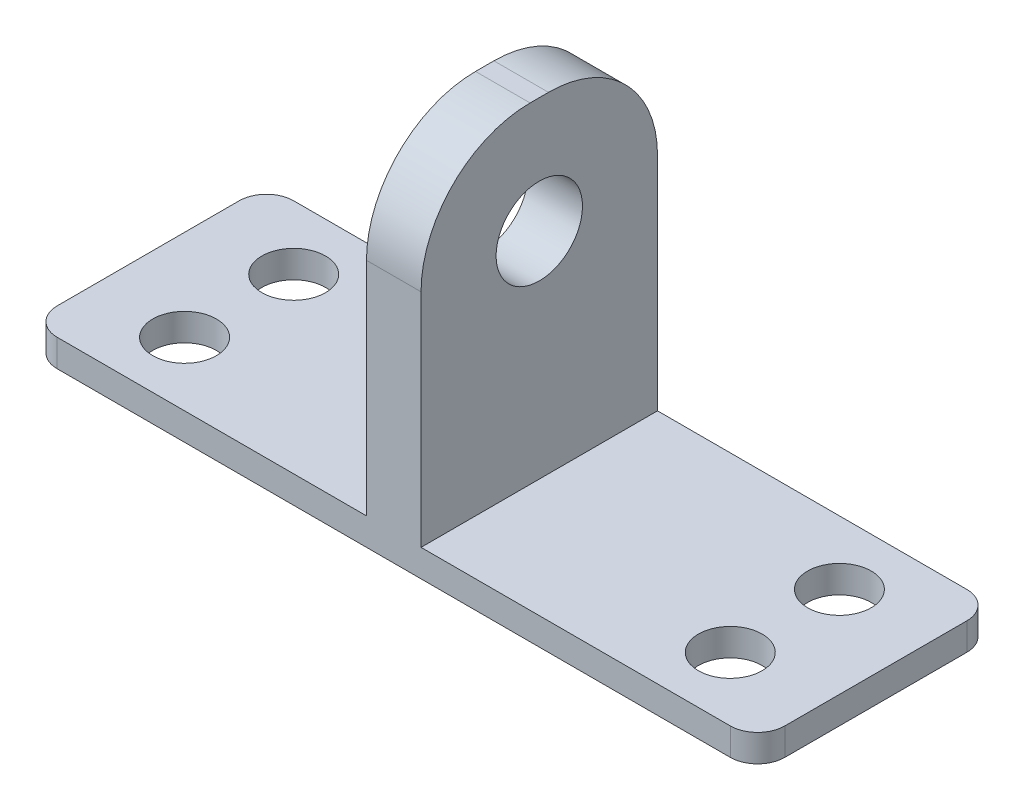
ISO-10303-21;
HEADER;
FILE_DESCRIPTION(('STEP AP214'),'2;1');
FILE_NAME('part.step','',(''),(''),'','','');
FILE_SCHEMA(('AUTOMOTIVE_DESIGN { 1 0 10303 214 1 1 1 1 }'));
ENDSEC;
DATA;
#1=APPLICATION_CONTEXT('core data for automotive mechanical design processes');
#2=APPLICATION_PROTOCOL_DEFINITION('international standard','automotive_design',2000,#1);
#3=PRODUCT_CONTEXT('',#1,'mechanical');
#4=PRODUCT('Part','Part','',(#3));
#5=PRODUCT_RELATED_PRODUCT_CATEGORY('part','',(#4));
#6=PRODUCT_DEFINITION_FORMATION('','',#4);
#7=PRODUCT_DEFINITION_CONTEXT('part definition',#1,'design');
#8=PRODUCT_DEFINITION('design','',#6,#7);
#9=PRODUCT_DEFINITION_SHAPE('','',#8);
#10=(LENGTH_UNIT() NAMED_UNIT(*) SI_UNIT(.MILLI.,.METRE.));
#11=(NAMED_UNIT(*) PLANE_ANGLE_UNIT() SI_UNIT($,.RADIAN.));
#12=(NAMED_UNIT(*) SI_UNIT($,.STERADIAN.) SOLID_ANGLE_UNIT());
#13=UNCERTAINTY_MEASURE_WITH_UNIT(LENGTH_MEASURE(1.E-05),#10,'distance_accuracy_value','');
#14=(GEOMETRIC_REPRESENTATION_CONTEXT(3) GLOBAL_UNCERTAINTY_ASSIGNED_CONTEXT((#13)) GLOBAL_UNIT_ASSIGNED_CONTEXT((#10,
#11,#12)) REPRESENTATION_CONTEXT('',''));
#15=CARTESIAN_POINT('',(0.,0.,0.));
#16=DIRECTION('',(0.,0.,1.));
#17=DIRECTION('',(1.,0.,0.));
#18=AXIS2_PLACEMENT_3D('',#15,#16,#17);
#19=CARTESIAN_POINT('',(0.,3.,0.));
#20=DIRECTION('',(0.,1.,0.));
#21=DIRECTION('',(0.,0.,1.));
#22=AXIS2_PLACEMENT_3D('',#19,#20,#21);
#23=PLANE('',#22);
#24=CARTESIAN_POINT('',(70.,3.,19.));
#25=DIRECTION('',(0.,1.,0.));
#26=DIRECTION('',(0.,0.,-1.));
#27=AXIS2_PLACEMENT_3D('',#24,#25,#26);
#28=CIRCLE('',#27,3.50000000000001);
#29=CARTESIAN_POINT('',(70.,3.,15.5));
#30=VERTEX_POINT('',#29);
#31=EDGE_CURVE('E246',#30,#30,#28,.T.);
#32=ORIENTED_EDGE('',*,*,#31,.F.);
#33=EDGE_LOOP('',(#32));
#34=FACE_BOUND('',#33,.T.);
#35=CARTESIAN_POINT('',(70.,3.,7.00000000000001));
#36=DIRECTION('',(0.,1.,0.));
#37=DIRECTION('',(0.,0.,1.));
#38=AXIS2_PLACEMENT_3D('',#35,#36,#37);
#39=CIRCLE('',#38,3.50000000000001);
#40=CARTESIAN_POINT('',(70.,3.,10.5));
#41=VERTEX_POINT('',#40);
#42=EDGE_CURVE('E253',#41,#41,#39,.T.);
#43=ORIENTED_EDGE('',*,*,#42,.F.);
#44=EDGE_LOOP('',(#43));
#45=FACE_BOUND('',#44,.T.);
#46=DIRECTION('',(-1.,0.,0.));
#47=VECTOR('',#46,1.);
#48=CARTESIAN_POINT('',(80.,3.,0.));
#49=LINE('',#48,#47);
#50=CARTESIAN_POINT('',(77.0028,3.,0.));
#51=VERTEX_POINT('',#50);
#52=CARTESIAN_POINT('',(43.,3.,0.));
#53=VERTEX_POINT('',#52);
#54=EDGE_CURVE('E139',#51,#53,#49,.T.);
#55=ORIENTED_EDGE('',*,*,#54,.T.);
#56=DIRECTION('',(0.,0.,1.));
#57=VECTOR('',#56,1.);
#58=CARTESIAN_POINT('',(43.,3.,0.));
#59=LINE('',#58,#57);
#60=CARTESIAN_POINT('',(43.,3.,26.));
#61=VERTEX_POINT('',#60);
#62=EDGE_CURVE('E148',#53,#61,#59,.T.);
#63=ORIENTED_EDGE('',*,*,#62,.T.);
#64=DIRECTION('',(1.,0.,0.));
#65=VECTOR('',#64,1.);
#66=CARTESIAN_POINT('',(0.,3.,26.));
#67=LINE('',#66,#65);
#68=CARTESIAN_POINT('',(77.0028,3.,26.));
#69=VERTEX_POINT('',#68);
#70=EDGE_CURVE('E242',#61,#69,#67,.T.);
#71=ORIENTED_EDGE('',*,*,#70,.T.);
#72=CARTESIAN_POINT('',(77.0028,3.,23.0028));
#73=DIRECTION('',(0.,1.,0.));
#74=DIRECTION('',(0.,0.,1.));
#75=AXIS2_PLACEMENT_3D('',#72,#73,#74);
#76=CIRCLE('',#75,2.9972);
#77=CARTESIAN_POINT('',(80.,3.,23.0028));
#78=VERTEX_POINT('',#77);
#79=EDGE_CURVE('E203',#69,#78,#76,.T.);
#80=ORIENTED_EDGE('',*,*,#79,.T.);
#81=DIRECTION('',(0.,0.,-1.));
#82=VECTOR('',#81,1.);
#83=CARTESIAN_POINT('',(80.,3.,26.));
#84=LINE('',#83,#82);
#85=CARTESIAN_POINT('',(80.,3.,2.99720000000001));
#86=VERTEX_POINT('',#85);
#87=EDGE_CURVE('E164',#78,#86,#84,.T.);
#88=ORIENTED_EDGE('',*,*,#87,.T.);
#89=CARTESIAN_POINT('',(77.0028,3.,2.9972));
#90=DIRECTION('',(0.,1.,0.));
#91=DIRECTION('',(0.,0.,1.));
#92=AXIS2_PLACEMENT_3D('',#89,#90,#91);
#93=CIRCLE('',#92,2.9972);
#94=EDGE_CURVE('E158',#86,#51,#93,.T.);
#95=ORIENTED_EDGE('',*,*,#94,.T.);
#96=EDGE_LOOP('',(#55,#63,#71,#80,#88,#95));
#97=FACE_BOUND('',#96,.T.);
#98=ADVANCED_FACE('F33',(#34,#45,#97),#23,.T.);
#99=DIRECTION('',(0.,0.,1.));
#100=VECTOR('',#99,1.);
#101=CARTESIAN_POINT('',(37.,3.,0.));
#102=LINE('',#101,#100);
#103=CARTESIAN_POINT('',(37.,3.,0.));
#104=VERTEX_POINT('',#103);
#105=CARTESIAN_POINT('',(37.,3.,26.));
#106=VERTEX_POINT('',#105);
#107=EDGE_CURVE('E153',#104,#106,#102,.T.);
#108=ORIENTED_EDGE('',*,*,#107,.F.);
#109=CARTESIAN_POINT('',(2.99720000000001,3.,0.));
#110=VERTEX_POINT('',#109);
#111=EDGE_CURVE('E160',#104,#110,#49,.T.);
#112=ORIENTED_EDGE('',*,*,#111,.T.);
#113=CARTESIAN_POINT('',(2.9972,3.,2.9972));
#114=DIRECTION('',(0.,1.,0.));
#115=DIRECTION('',(0.,0.,1.));
#116=AXIS2_PLACEMENT_3D('',#113,#114,#115);
#117=CIRCLE('',#116,2.9972);
#118=CARTESIAN_POINT('',(0.,3.,2.9972));
#119=VERTEX_POINT('',#118);
#120=EDGE_CURVE('E199',#110,#119,#117,.T.);
#121=ORIENTED_EDGE('',*,*,#120,.T.);
#122=DIRECTION('',(0.,0.,1.));
#123=VECTOR('',#122,1.);
#124=CARTESIAN_POINT('',(0.,3.,0.));
#125=LINE('',#124,#123);
#126=CARTESIAN_POINT('',(0.,3.,23.0028));
#127=VERTEX_POINT('',#126);
#128=EDGE_CURVE('E180',#119,#127,#125,.T.);
#129=ORIENTED_EDGE('',*,*,#128,.T.);
#130=CARTESIAN_POINT('',(2.9972,3.,23.0028));
#131=DIRECTION('',(0.,1.,0.));
#132=DIRECTION('',(0.,0.,1.));
#133=AXIS2_PLACEMENT_3D('',#130,#131,#132);
#134=CIRCLE('',#133,2.9972);
#135=CARTESIAN_POINT('',(2.9972,3.,26.));
#136=VERTEX_POINT('',#135);
#137=EDGE_CURVE('E201',#127,#136,#134,.T.);
#138=ORIENTED_EDGE('',*,*,#137,.T.);
#139=EDGE_CURVE('E270',#136,#106,#67,.T.);
#140=ORIENTED_EDGE('',*,*,#139,.T.);
#141=EDGE_LOOP('',(#108,#112,#121,#129,#138,#140));
#142=FACE_BOUND('',#141,.T.);
#143=CARTESIAN_POINT('',(10.,3.,19.));
#144=DIRECTION('',(0.,1.,0.));
#145=DIRECTION('',(0.,0.,1.));
#146=AXIS2_PLACEMENT_3D('',#143,#144,#145);
#147=CIRCLE('',#146,3.5);
#148=CARTESIAN_POINT('',(10.,3.,22.5));
#149=VERTEX_POINT('',#148);
#150=EDGE_CURVE('E172',#149,#149,#147,.T.);
#151=ORIENTED_EDGE('',*,*,#150,.F.);
#152=EDGE_LOOP('',(#151));
#153=FACE_BOUND('',#152,.T.);
#154=CARTESIAN_POINT('',(9.99999999999999,3.,7.00000000000001));
#155=DIRECTION('',(0.,1.,0.));
#156=DIRECTION('',(0.,0.,-1.));
#157=AXIS2_PLACEMENT_3D('',#154,#155,#156);
#158=CIRCLE('',#157,3.5);
#159=CARTESIAN_POINT('',(9.99999999999999,3.,3.50000000000001));
#160=VERTEX_POINT('',#159);
#161=EDGE_CURVE('E259',#160,#160,#158,.T.);
#162=ORIENTED_EDGE('',*,*,#161,.F.);
#163=EDGE_LOOP('',(#162));
#164=FACE_BOUND('',#163,.T.);
#165=ADVANCED_FACE('F299',(#142,#153,#164),#23,.T.);
#166=CARTESIAN_POINT('',(0.,0.,0.));
#167=DIRECTION('',(0.,1.,0.));
#168=DIRECTION('',(0.,0.,1.));
#169=AXIS2_PLACEMENT_3D('',#166,#167,#168);
#170=PLANE('',#169);
#171=DIRECTION('',(0.,0.,-1.));
#172=VECTOR('',#171,1.);
#173=CARTESIAN_POINT('',(80.,0.,26.));
#174=LINE('',#173,#172);
#175=CARTESIAN_POINT('',(80.,0.,23.0028));
#176=VERTEX_POINT('',#175);
#177=CARTESIAN_POINT('',(80.,0.,2.99720000000001));
#178=VERTEX_POINT('',#177);
#179=EDGE_CURVE('E175',#176,#178,#174,.T.);
#180=ORIENTED_EDGE('',*,*,#179,.F.);
#181=CARTESIAN_POINT('',(77.0028,0.,23.0028));
#182=DIRECTION('',(0.,1.,0.));
#183=DIRECTION('',(0.,0.,1.));
#184=AXIS2_PLACEMENT_3D('',#181,#182,#183);
#185=CIRCLE('',#184,2.9972);
#186=CARTESIAN_POINT('',(77.0028,0.,26.));
#187=VERTEX_POINT('',#186);
#188=EDGE_CURVE('E190',#176,#187,#185,.F.);
#189=ORIENTED_EDGE('',*,*,#188,.T.);
#190=DIRECTION('',(1.,0.,0.));
#191=VECTOR('',#190,1.);
#192=CARTESIAN_POINT('',(0.,0.,26.));
#193=LINE('',#192,#191);
#194=CARTESIAN_POINT('',(2.9972,0.,26.));
#195=VERTEX_POINT('',#194);
#196=EDGE_CURVE('E171',#195,#187,#193,.T.);
#197=ORIENTED_EDGE('',*,*,#196,.F.);
#198=CARTESIAN_POINT('',(2.9972,0.,23.0028));
#199=DIRECTION('',(0.,1.,0.));
#200=DIRECTION('',(0.,0.,1.));
#201=AXIS2_PLACEMENT_3D('',#198,#199,#200);
#202=CIRCLE('',#201,2.9972);
#203=CARTESIAN_POINT('',(0.,0.,23.0028));
#204=VERTEX_POINT('',#203);
#205=EDGE_CURVE('E188',#195,#204,#202,.F.);
#206=ORIENTED_EDGE('',*,*,#205,.T.);
#207=DIRECTION('',(0.,0.,1.));
#208=VECTOR('',#207,1.);
#209=CARTESIAN_POINT('',(0.,0.,0.));
#210=LINE('',#209,#208);
#211=CARTESIAN_POINT('',(0.,0.,2.9972));
#212=VERTEX_POINT('',#211);
#213=EDGE_CURVE('E168',#212,#204,#210,.T.);
#214=ORIENTED_EDGE('',*,*,#213,.F.);
#215=CARTESIAN_POINT('',(2.9972,0.,2.9972));
#216=DIRECTION('',(0.,1.,0.));
#217=DIRECTION('',(0.,0.,1.));
#218=AXIS2_PLACEMENT_3D('',#215,#216,#217);
#219=CIRCLE('',#218,2.9972);
#220=CARTESIAN_POINT('',(2.99720000000001,0.,0.));
#221=VERTEX_POINT('',#220);
#222=EDGE_CURVE('E186',#212,#221,#219,.F.);
#223=ORIENTED_EDGE('',*,*,#222,.T.);
#224=DIRECTION('',(-1.,0.,0.));
#225=VECTOR('',#224,1.);
#226=CARTESIAN_POINT('',(80.,0.,0.));
#227=LINE('',#226,#225);
#228=CARTESIAN_POINT('',(77.0028,0.,0.));
#229=VERTEX_POINT('',#228);
#230=EDGE_CURVE('E178',#229,#221,#227,.T.);
#231=ORIENTED_EDGE('',*,*,#230,.F.);
#232=CARTESIAN_POINT('',(77.0028,0.,2.9972));
#233=DIRECTION('',(0.,1.,0.));
#234=DIRECTION('',(0.,0.,1.));
#235=AXIS2_PLACEMENT_3D('',#232,#233,#234);
#236=CIRCLE('',#235,2.9972);
#237=EDGE_CURVE('E184',#229,#178,#236,.F.);
#238=ORIENTED_EDGE('',*,*,#237,.T.);
#239=EDGE_LOOP('',(#180,#189,#197,#206,#214,#223,#231,#238));
#240=FACE_BOUND('',#239,.T.);
#241=CARTESIAN_POINT('',(10.,0.,19.));
#242=DIRECTION('',(0.,1.,0.));
#243=DIRECTION('',(0.,0.,1.));
#244=AXIS2_PLACEMENT_3D('',#241,#242,#243);
#245=CIRCLE('',#244,3.5);
#246=CARTESIAN_POINT('',(10.,0.,22.5));
#247=VERTEX_POINT('',#246);
#248=EDGE_CURVE('E262',#247,#247,#245,.T.);
#249=ORIENTED_EDGE('',*,*,#248,.T.);
#250=EDGE_LOOP('',(#249));
#251=FACE_BOUND('',#250,.T.);
#252=CARTESIAN_POINT('',(9.99999999999999,0.,7.00000000000001));
#253=DIRECTION('',(0.,1.,0.));
#254=DIRECTION('',(0.,0.,-1.));
#255=AXIS2_PLACEMENT_3D('',#252,#253,#254);
#256=CIRCLE('',#255,3.5);
#257=CARTESIAN_POINT('',(9.99999999999999,0.,3.50000000000001));
#258=VERTEX_POINT('',#257);
#259=EDGE_CURVE('E256',#258,#258,#256,.T.);
#260=ORIENTED_EDGE('',*,*,#259,.T.);
#261=EDGE_LOOP('',(#260));
#262=FACE_BOUND('',#261,.T.);
#263=CARTESIAN_POINT('',(70.,0.,7.00000000000001));
#264=DIRECTION('',(0.,1.,0.));
#265=DIRECTION('',(0.,0.,1.));
#266=AXIS2_PLACEMENT_3D('',#263,#264,#265);
#267=CIRCLE('',#266,3.50000000000001);
#268=CARTESIAN_POINT('',(70.,0.,10.5));
#269=VERTEX_POINT('',#268);
#270=EDGE_CURVE('E251',#269,#269,#267,.T.);
#271=ORIENTED_EDGE('',*,*,#270,.T.);
#272=EDGE_LOOP('',(#271));
#273=FACE_BOUND('',#272,.T.);
#274=CARTESIAN_POINT('',(70.,0.,19.));
#275=DIRECTION('',(0.,1.,0.));
#276=DIRECTION('',(0.,0.,-1.));
#277=AXIS2_PLACEMENT_3D('',#274,#275,#276);
#278=CIRCLE('',#277,3.50000000000001);
#279=CARTESIAN_POINT('',(70.,0.,15.5));
#280=VERTEX_POINT('',#279);
#281=EDGE_CURVE('E243',#280,#280,#278,.T.);
#282=ORIENTED_EDGE('',*,*,#281,.T.);
#283=EDGE_LOOP('',(#282));
#284=FACE_BOUND('',#283,.T.);
#285=ADVANCED_FACE('F287',(#240,#251,#262,#273,#284),#170,.F.);
#286=CARTESIAN_POINT('',(0.,3.,0.));
#287=DIRECTION('',(1.,0.,0.));
#288=DIRECTION('',(0.,0.,-1.));
#289=AXIS2_PLACEMENT_3D('',#286,#287,#288);
#290=PLANE('',#289);
#291=ORIENTED_EDGE('',*,*,#213,.T.);
#292=DIRECTION('',(0.,-1.,0.));
#293=VECTOR('',#292,1.);
#294=CARTESIAN_POINT('',(0.,3.,23.0028));
#295=LINE('',#294,#293);
#296=EDGE_CURVE('E208',#204,#127,#295,.F.);
#297=ORIENTED_EDGE('',*,*,#296,.T.);
#298=ORIENTED_EDGE('',*,*,#128,.F.);
#299=DIRECTION('',(0.,-1.,0.));
#300=VECTOR('',#299,1.);
#301=CARTESIAN_POINT('',(0.,3.,2.9972));
#302=LINE('',#301,#300);
#303=EDGE_CURVE('E205',#119,#212,#302,.T.);
#304=ORIENTED_EDGE('',*,*,#303,.T.);
#305=EDGE_LOOP('',(#291,#297,#298,#304));
#306=FACE_BOUND('',#305,.T.);
#307=ADVANCED_FACE('F303',(#306),#290,.F.);
#308=CARTESIAN_POINT('',(0.,3.,26.));
#309=DIRECTION('',(0.,0.,-1.));
#310=DIRECTION('',(-1.,0.,0.));
#311=AXIS2_PLACEMENT_3D('',#308,#309,#310);
#312=PLANE('',#311);
#313=DIRECTION('',(0.,-1.,0.));
#314=VECTOR('',#313,1.);
#315=CARTESIAN_POINT('',(43.,39.322,26.));
#316=LINE('',#315,#314);
#317=CARTESIAN_POINT('',(43.,27.3332,26.));
#318=VERTEX_POINT('',#317);
#319=EDGE_CURVE('E144',#318,#61,#316,.T.);
#320=ORIENTED_EDGE('',*,*,#319,.F.);
#321=DIRECTION('',(1.,0.,0.));
#322=VECTOR('',#321,1.);
#323=CARTESIAN_POINT('',(0.,27.3332,26.));
#324=LINE('',#323,#322);
#325=CARTESIAN_POINT('',(37.,27.3332,26.));
#326=VERTEX_POINT('',#325);
#327=EDGE_CURVE('E56',#318,#326,#324,.F.);
#328=ORIENTED_EDGE('',*,*,#327,.T.);
#329=DIRECTION('',(0.,-1.,0.));
#330=VECTOR('',#329,1.);
#331=CARTESIAN_POINT('',(37.,39.322,26.));
#332=LINE('',#331,#330);
#333=EDGE_CURVE('E231',#326,#106,#332,.T.);
#334=ORIENTED_EDGE('',*,*,#333,.T.);
#335=ORIENTED_EDGE('',*,*,#139,.F.);
#336=DIRECTION('',(0.,-1.,0.));
#337=VECTOR('',#336,1.);
#338=CARTESIAN_POINT('',(2.9972,3.,26.));
#339=LINE('',#338,#337);
#340=EDGE_CURVE('E192',#136,#195,#339,.T.);
#341=ORIENTED_EDGE('',*,*,#340,.T.);
#342=ORIENTED_EDGE('',*,*,#196,.T.);
#343=DIRECTION('',(0.,-1.,0.));
#344=VECTOR('',#343,1.);
#345=CARTESIAN_POINT('',(77.0028,3.,26.));
#346=LINE('',#345,#344);
#347=EDGE_CURVE('E195',#187,#69,#346,.F.);
#348=ORIENTED_EDGE('',*,*,#347,.T.);
#349=ORIENTED_EDGE('',*,*,#70,.F.);
#350=EDGE_LOOP('',(#320,#328,#334,#335,#341,#342,#348,#349));
#351=FACE_BOUND('',#350,.T.);
#352=ADVANCED_FACE('F241',(#351),#312,.F.);
#353=CARTESIAN_POINT('',(80.,3.,26.));
#354=DIRECTION('',(-1.,0.,0.));
#355=DIRECTION('',(0.,0.,1.));
#356=AXIS2_PLACEMENT_3D('',#353,#354,#355);
#357=PLANE('',#356);
#358=ORIENTED_EDGE('',*,*,#87,.F.);
#359=DIRECTION('',(0.,-1.,0.));
#360=VECTOR('',#359,1.);
#361=CARTESIAN_POINT('',(80.,3.,23.0028));
#362=LINE('',#361,#360);
#363=EDGE_CURVE('E162',#78,#176,#362,.T.);
#364=ORIENTED_EDGE('',*,*,#363,.T.);
#365=ORIENTED_EDGE('',*,*,#179,.T.);
#366=DIRECTION('',(0.,-1.,0.));
#367=VECTOR('',#366,1.);
#368=CARTESIAN_POINT('',(80.,3.,2.9972));
#369=LINE('',#368,#367);
#370=EDGE_CURVE('E159',#178,#86,#369,.F.);
#371=ORIENTED_EDGE('',*,*,#370,.T.);
#372=EDGE_LOOP('',(#358,#364,#365,#371));
#373=FACE_BOUND('',#372,.T.);
#374=ADVANCED_FACE('F284',(#373),#357,.F.);
#375=CARTESIAN_POINT('',(80.,3.,0.));
#376=DIRECTION('',(0.,0.,1.));
#377=DIRECTION('',(1.,0.,0.));
#378=AXIS2_PLACEMENT_3D('',#375,#376,#377);
#379=PLANE('',#378);
#380=DIRECTION('',(0.,-1.,0.));
#381=VECTOR('',#380,1.);
#382=CARTESIAN_POINT('',(37.,39.322,0.));
#383=LINE('',#382,#381);
#384=CARTESIAN_POINT('',(37.,27.3332,0.));
#385=VERTEX_POINT('',#384);
#386=EDGE_CURVE('E145',#385,#104,#383,.T.);
#387=ORIENTED_EDGE('',*,*,#386,.F.);
#388=DIRECTION('',(-1.,0.,0.));
#389=VECTOR('',#388,1.);
#390=CARTESIAN_POINT('',(80.,27.3332,0.));
#391=LINE('',#390,#389);
#392=CARTESIAN_POINT('',(43.,27.3332,0.));
#393=VERTEX_POINT('',#392);
#394=EDGE_CURVE('E11',#385,#393,#391,.F.);
#395=ORIENTED_EDGE('',*,*,#394,.T.);
#396=DIRECTION('',(0.,-1.,0.));
#397=VECTOR('',#396,1.);
#398=CARTESIAN_POINT('',(43.,39.322,0.));
#399=LINE('',#398,#397);
#400=EDGE_CURVE('E134',#393,#53,#399,.T.);
#401=ORIENTED_EDGE('',*,*,#400,.T.);
#402=ORIENTED_EDGE('',*,*,#54,.F.);
#403=DIRECTION('',(0.,-1.,0.));
#404=VECTOR('',#403,1.);
#405=CARTESIAN_POINT('',(77.0028,3.,0.));
#406=LINE('',#405,#404);
#407=EDGE_CURVE('E210',#51,#229,#406,.T.);
#408=ORIENTED_EDGE('',*,*,#407,.T.);
#409=ORIENTED_EDGE('',*,*,#230,.T.);
#410=DIRECTION('',(0.,-1.,0.));
#411=VECTOR('',#410,1.);
#412=CARTESIAN_POINT('',(2.99720000000001,3.,0.));
#413=LINE('',#412,#411);
#414=EDGE_CURVE('E212',#221,#110,#413,.F.);
#415=ORIENTED_EDGE('',*,*,#414,.T.);
#416=ORIENTED_EDGE('',*,*,#111,.F.);
#417=EDGE_LOOP('',(#387,#395,#401,#402,#408,#409,#415,#416));
#418=FACE_BOUND('',#417,.T.);
#419=ADVANCED_FACE('F136',(#418),#379,.F.);
#420=CARTESIAN_POINT('',(10.,3.,19.));
#421=DIRECTION('',(0.,-1.,0.));
#422=DIRECTION('',(0.,0.,-1.));
#423=AXIS2_PLACEMENT_3D('',#420,#421,#422);
#424=CYLINDRICAL_SURFACE('',#423,3.5);
#425=ORIENTED_EDGE('',*,*,#150,.T.);
#426=EDGE_LOOP('',(#425));
#427=FACE_BOUND('',#426,.T.);
#428=ORIENTED_EDGE('',*,*,#248,.F.);
#429=EDGE_LOOP('',(#428));
#430=FACE_BOUND('',#429,.T.);
#431=ADVANCED_FACE('F340',(#427,#430),#424,.F.);
#432=CARTESIAN_POINT('',(9.99999999999999,3.,7.00000000000001));
#433=DIRECTION('',(0.,-1.,0.));
#434=DIRECTION('',(0.,0.,-1.));
#435=AXIS2_PLACEMENT_3D('',#432,#433,#434);
#436=CYLINDRICAL_SURFACE('',#435,3.5);
#437=ORIENTED_EDGE('',*,*,#161,.T.);
#438=EDGE_LOOP('',(#437));
#439=FACE_BOUND('',#438,.T.);
#440=ORIENTED_EDGE('',*,*,#259,.F.);
#441=EDGE_LOOP('',(#440));
#442=FACE_BOUND('',#441,.T.);
#443=ADVANCED_FACE('F485',(#439,#442),#436,.F.);
#444=CARTESIAN_POINT('',(70.,3.,7.00000000000001));
#445=DIRECTION('',(0.,-1.,0.));
#446=DIRECTION('',(0.,0.,-1.));
#447=AXIS2_PLACEMENT_3D('',#444,#445,#446);
#448=CYLINDRICAL_SURFACE('',#447,3.50000000000001);
#449=ORIENTED_EDGE('',*,*,#42,.T.);
#450=EDGE_LOOP('',(#449));
#451=FACE_BOUND('',#450,.T.);
#452=ORIENTED_EDGE('',*,*,#270,.F.);
#453=EDGE_LOOP('',(#452));
#454=FACE_BOUND('',#453,.T.);
#455=ADVANCED_FACE('F475',(#451,#454),#448,.F.);
#456=CARTESIAN_POINT('',(70.,3.,19.));
#457=DIRECTION('',(0.,-1.,0.));
#458=DIRECTION('',(0.,0.,-1.));
#459=AXIS2_PLACEMENT_3D('',#456,#457,#458);
#460=CYLINDRICAL_SURFACE('',#459,3.50000000000001);
#461=ORIENTED_EDGE('',*,*,#31,.T.);
#462=EDGE_LOOP('',(#461));
#463=FACE_BOUND('',#462,.T.);
#464=ORIENTED_EDGE('',*,*,#281,.F.);
#465=EDGE_LOOP('',(#464));
#466=FACE_BOUND('',#465,.T.);
#467=ADVANCED_FACE('F354',(#463,#466),#460,.F.);
#468=CARTESIAN_POINT('',(77.0028,3.,23.0028));
#469=DIRECTION('',(0.,-1.,0.));
#470=DIRECTION('',(0.,0.,-1.));
#471=AXIS2_PLACEMENT_3D('',#468,#469,#470);
#472=CYLINDRICAL_SURFACE('',#471,2.9972);
#473=ORIENTED_EDGE('',*,*,#79,.F.);
#474=ORIENTED_EDGE('',*,*,#347,.F.);
#475=ORIENTED_EDGE('',*,*,#188,.F.);
#476=ORIENTED_EDGE('',*,*,#363,.F.);
#477=EDGE_LOOP('',(#473,#474,#475,#476));
#478=FACE_BOUND('',#477,.T.);
#479=ADVANCED_FACE('F281',(#478),#472,.T.);
#480=CARTESIAN_POINT('',(2.9972,3.,23.0028));
#481=DIRECTION('',(0.,-1.,0.));
#482=DIRECTION('',(0.,0.,-1.));
#483=AXIS2_PLACEMENT_3D('',#480,#481,#482);
#484=CYLINDRICAL_SURFACE('',#483,2.9972);
#485=ORIENTED_EDGE('',*,*,#137,.F.);
#486=ORIENTED_EDGE('',*,*,#296,.F.);
#487=ORIENTED_EDGE('',*,*,#205,.F.);
#488=ORIENTED_EDGE('',*,*,#340,.F.);
#489=EDGE_LOOP('',(#485,#486,#487,#488));
#490=FACE_BOUND('',#489,.T.);
#491=ADVANCED_FACE('F307',(#490),#484,.T.);
#492=CARTESIAN_POINT('',(2.9972,3.,2.9972));
#493=DIRECTION('',(0.,-1.,0.));
#494=DIRECTION('',(0.,0.,-1.));
#495=AXIS2_PLACEMENT_3D('',#492,#493,#494);
#496=CYLINDRICAL_SURFACE('',#495,2.9972);
#497=ORIENTED_EDGE('',*,*,#120,.F.);
#498=ORIENTED_EDGE('',*,*,#414,.F.);
#499=ORIENTED_EDGE('',*,*,#222,.F.);
#500=ORIENTED_EDGE('',*,*,#303,.F.);
#501=EDGE_LOOP('',(#497,#498,#499,#500));
#502=FACE_BOUND('',#501,.T.);
#503=ADVANCED_FACE('F296',(#502),#496,.T.);
#504=CARTESIAN_POINT('',(77.0028,3.,2.9972));
#505=DIRECTION('',(0.,-1.,0.));
#506=DIRECTION('',(0.,0.,-1.));
#507=AXIS2_PLACEMENT_3D('',#504,#505,#506);
#508=CYLINDRICAL_SURFACE('',#507,2.9972);
#509=ORIENTED_EDGE('',*,*,#94,.F.);
#510=ORIENTED_EDGE('',*,*,#370,.F.);
#511=ORIENTED_EDGE('',*,*,#237,.F.);
#512=ORIENTED_EDGE('',*,*,#407,.F.);
#513=EDGE_LOOP('',(#509,#510,#511,#512));
#514=FACE_BOUND('',#513,.T.);
#515=ADVANCED_FACE('F291',(#514),#508,.T.);
#516=CARTESIAN_POINT('',(43.,39.322,0.));
#517=DIRECTION('',(1.,0.,0.));
#518=DIRECTION('',(0.,0.,-1.));
#519=AXIS2_PLACEMENT_3D('',#516,#517,#518);
#520=PLANE('',#519);
#521=CARTESIAN_POINT('',(43.,26.622,13.));
#522=DIRECTION('',(1.,0.,0.));
#523=DIRECTION('',(0.,0.,-1.));
#524=AXIS2_PLACEMENT_3D('',#521,#522,#523);
#525=CIRCLE('',#524,4.75);
#526=CARTESIAN_POINT('',(43.,26.622,8.24999999999999));
#527=VERTEX_POINT('',#526);
#528=EDGE_CURVE('E313',#527,#527,#525,.F.);
#529=ORIENTED_EDGE('',*,*,#528,.T.);
#530=EDGE_LOOP('',(#529));
#531=FACE_BOUND('',#530,.T.);
#532=DIRECTION('',(0.,0.,1.));
#533=VECTOR('',#532,1.);
#534=CARTESIAN_POINT('',(43.,39.322,0.));
#535=LINE('',#534,#533);
#536=CARTESIAN_POINT('',(43.,39.322,11.9888));
#537=VERTEX_POINT('',#536);
#538=CARTESIAN_POINT('',(43.,39.322,14.0112));
#539=VERTEX_POINT('',#538);
#540=EDGE_CURVE('E238',#537,#539,#535,.T.);
#541=ORIENTED_EDGE('',*,*,#540,.T.);
#542=CARTESIAN_POINT('',(43.,27.3332,14.0112));
#543=DIRECTION('',(1.,0.,0.));
#544=DIRECTION('',(0.,0.,-1.));
#545=AXIS2_PLACEMENT_3D('',#542,#543,#544);
#546=CIRCLE('',#545,11.9888);
#547=EDGE_CURVE('E223',#539,#318,#546,.T.);
#548=ORIENTED_EDGE('',*,*,#547,.T.);
#549=ORIENTED_EDGE('',*,*,#319,.T.);
#550=ORIENTED_EDGE('',*,*,#62,.F.);
#551=ORIENTED_EDGE('',*,*,#400,.F.);
#552=CARTESIAN_POINT('',(43.,27.3332,11.9888));
#553=DIRECTION('',(1.,0.,0.));
#554=DIRECTION('',(0.,0.,-1.));
#555=AXIS2_PLACEMENT_3D('',#552,#553,#554);
#556=CIRCLE('',#555,11.9888);
#557=EDGE_CURVE('E221',#393,#537,#556,.T.);
#558=ORIENTED_EDGE('',*,*,#557,.T.);
#559=EDGE_LOOP('',(#541,#548,#549,#550,#551,#558));
#560=FACE_BOUND('',#559,.T.);
#561=ADVANCED_FACE('F150',(#531,#560),#520,.T.);
#562=CARTESIAN_POINT('',(37.,39.322,0.));
#563=DIRECTION('',(1.,0.,0.));
#564=DIRECTION('',(0.,0.,-1.));
#565=AXIS2_PLACEMENT_3D('',#562,#563,#564);
#566=PLANE('',#565);
#567=CARTESIAN_POINT('',(37.,26.622,13.));
#568=DIRECTION('',(-1.,0.,0.));
#569=DIRECTION('',(0.,0.,1.));
#570=AXIS2_PLACEMENT_3D('',#567,#568,#569);
#571=CIRCLE('',#570,4.75);
#572=CARTESIAN_POINT('',(37.,26.622,17.75));
#573=VERTEX_POINT('',#572);
#574=EDGE_CURVE('E154',#573,#573,#571,.T.);
#575=ORIENTED_EDGE('',*,*,#574,.F.);
#576=EDGE_LOOP('',(#575));
#577=FACE_BOUND('',#576,.T.);
#578=ORIENTED_EDGE('',*,*,#333,.F.);
#579=CARTESIAN_POINT('',(37.,27.3332,14.0112));
#580=DIRECTION('',(1.,0.,0.));
#581=DIRECTION('',(0.,0.,-1.));
#582=AXIS2_PLACEMENT_3D('',#579,#580,#581);
#583=CIRCLE('',#582,11.9888);
#584=CARTESIAN_POINT('',(37.,39.322,14.0112));
#585=VERTEX_POINT('',#584);
#586=EDGE_CURVE('E41',#326,#585,#583,.F.);
#587=ORIENTED_EDGE('',*,*,#586,.T.);
#588=DIRECTION('',(0.,0.,1.));
#589=VECTOR('',#588,1.);
#590=CARTESIAN_POINT('',(37.,39.322,0.));
#591=LINE('',#590,#589);
#592=CARTESIAN_POINT('',(37.,39.322,11.9888));
#593=VERTEX_POINT('',#592);
#594=EDGE_CURVE('E229',#593,#585,#591,.T.);
#595=ORIENTED_EDGE('',*,*,#594,.F.);
#596=CARTESIAN_POINT('',(37.,27.3332,11.9888));
#597=DIRECTION('',(1.,0.,0.));
#598=DIRECTION('',(0.,0.,-1.));
#599=AXIS2_PLACEMENT_3D('',#596,#597,#598);
#600=CIRCLE('',#599,11.9888);
#601=EDGE_CURVE('E48',#593,#385,#600,.F.);
#602=ORIENTED_EDGE('',*,*,#601,.T.);
#603=ORIENTED_EDGE('',*,*,#386,.T.);
#604=ORIENTED_EDGE('',*,*,#107,.T.);
#605=EDGE_LOOP('',(#578,#587,#595,#602,#603,#604));
#606=FACE_BOUND('',#605,.T.);
#607=ADVANCED_FACE('F228',(#577,#606),#566,.F.);
#608=CARTESIAN_POINT('',(0.,39.322,0.));
#609=DIRECTION('',(0.,-1.,0.));
#610=DIRECTION('',(0.,0.,-1.));
#611=AXIS2_PLACEMENT_3D('',#608,#609,#610);
#612=PLANE('',#611);
#613=ORIENTED_EDGE('',*,*,#594,.T.);
#614=DIRECTION('',(1.,0.,0.));
#615=VECTOR('',#614,1.);
#616=CARTESIAN_POINT('',(0.,39.322,14.0112));
#617=LINE('',#616,#615);
#618=EDGE_CURVE('E218',#585,#539,#617,.T.);
#619=ORIENTED_EDGE('',*,*,#618,.T.);
#620=ORIENTED_EDGE('',*,*,#540,.F.);
#621=DIRECTION('',(-1.,0.,0.));
#622=VECTOR('',#621,1.);
#623=CARTESIAN_POINT('',(0.,39.322,11.9888));
#624=LINE('',#623,#622);
#625=EDGE_CURVE('E215',#537,#593,#624,.T.);
#626=ORIENTED_EDGE('',*,*,#625,.T.);
#627=EDGE_LOOP('',(#613,#619,#620,#626));
#628=FACE_BOUND('',#627,.T.);
#629=ADVANCED_FACE('F235',(#628),#612,.F.);
#630=CARTESIAN_POINT('',(0.,27.3332,14.0112));
#631=DIRECTION('',(1.,0.,0.));
#632=DIRECTION('',(0.,0.,-1.));
#633=AXIS2_PLACEMENT_3D('',#630,#631,#632);
#634=CYLINDRICAL_SURFACE('',#633,11.9888);
#635=ORIENTED_EDGE('',*,*,#586,.F.);
#636=ORIENTED_EDGE('',*,*,#327,.F.);
#637=ORIENTED_EDGE('',*,*,#547,.F.);
#638=ORIENTED_EDGE('',*,*,#618,.F.);
#639=EDGE_LOOP('',(#635,#636,#637,#638));
#640=FACE_BOUND('',#639,.T.);
#641=ADVANCED_FACE('F240',(#640),#634,.T.);
#642=CARTESIAN_POINT('',(0.,27.3332,11.9888));
#643=DIRECTION('',(-1.,0.,0.));
#644=DIRECTION('',(0.,0.,1.));
#645=AXIS2_PLACEMENT_3D('',#642,#643,#644);
#646=CYLINDRICAL_SURFACE('',#645,11.9888);
#647=ORIENTED_EDGE('',*,*,#557,.F.);
#648=ORIENTED_EDGE('',*,*,#394,.F.);
#649=ORIENTED_EDGE('',*,*,#601,.F.);
#650=ORIENTED_EDGE('',*,*,#625,.F.);
#651=EDGE_LOOP('',(#647,#648,#649,#650));
#652=FACE_BOUND('',#651,.T.);
#653=ADVANCED_FACE('F35',(#652),#646,.T.);
#654=CARTESIAN_POINT('',(80.001,26.622,13.));
#655=DIRECTION('',(-1.,0.,0.));
#656=DIRECTION('',(0.,0.,1.));
#657=AXIS2_PLACEMENT_3D('',#654,#655,#656);
#658=CYLINDRICAL_SURFACE('',#657,4.75);
#659=ORIENTED_EDGE('',*,*,#528,.F.);
#660=EDGE_LOOP('',(#659));
#661=FACE_BOUND('',#660,.T.);
#662=ORIENTED_EDGE('',*,*,#574,.T.);
#663=EDGE_LOOP('',(#662));
#664=FACE_BOUND('',#663,.T.);
#665=ADVANCED_FACE('F319',(#661,#664),#658,.F.);
#666=CLOSED_SHELL('',(#98,#165,#285,#307,#352,#374,#419,#431,#443,#455,#467,#479,#491,#503,#515,
#561,#607,#629,#641,#653,#665));
#667=MANIFOLD_SOLID_BREP('B2',#666);
#668=ADVANCED_BREP_SHAPE_REPRESENTATION('',(#18,#667),#14);
#669=SHAPE_DEFINITION_REPRESENTATION(#9,#668);
ENDSEC;
END-ISO-10303-21;
